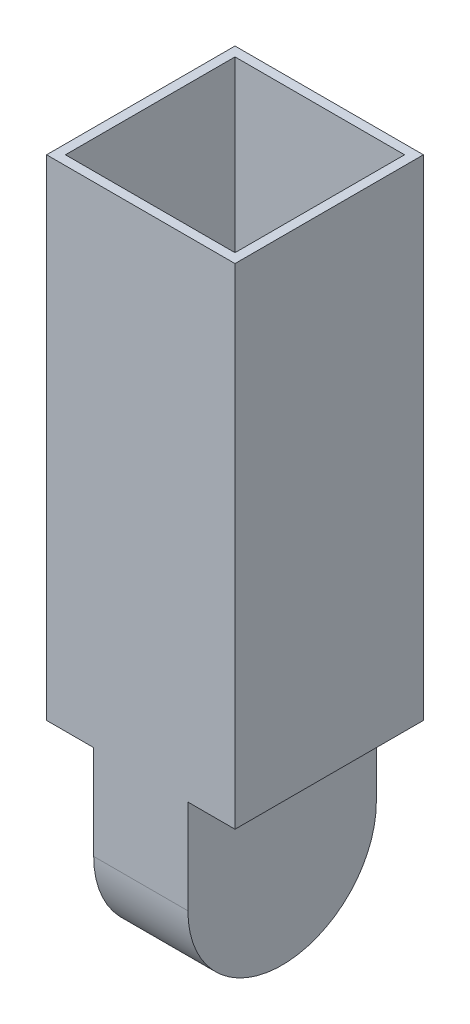
ISO-10303-21;
HEADER;
FILE_DESCRIPTION(('STEP AP214'),'2;1');
FILE_NAME('part.step','',(''),(''),'','','');
FILE_SCHEMA(('AUTOMOTIVE_DESIGN { 1 0 10303 214 1 1 1 1 }'));
ENDSEC;
DATA;
#1=APPLICATION_CONTEXT('core data for automotive mechanical design processes');
#2=APPLICATION_PROTOCOL_DEFINITION('international standard','automotive_design',2000,#1);
#3=PRODUCT_CONTEXT('',#1,'mechanical');
#4=PRODUCT('Part','Part','',(#3));
#5=PRODUCT_RELATED_PRODUCT_CATEGORY('part','',(#4));
#6=PRODUCT_DEFINITION_FORMATION('','',#4);
#7=PRODUCT_DEFINITION_CONTEXT('part definition',#1,'design');
#8=PRODUCT_DEFINITION('design','',#6,#7);
#9=PRODUCT_DEFINITION_SHAPE('','',#8);
#10=(LENGTH_UNIT() NAMED_UNIT(*) SI_UNIT(.MILLI.,.METRE.));
#11=(NAMED_UNIT(*) PLANE_ANGLE_UNIT() SI_UNIT($,.RADIAN.));
#12=(NAMED_UNIT(*) SI_UNIT($,.STERADIAN.) SOLID_ANGLE_UNIT());
#13=UNCERTAINTY_MEASURE_WITH_UNIT(LENGTH_MEASURE(1.E-05),#10,'distance_accuracy_value','');
#14=(GEOMETRIC_REPRESENTATION_CONTEXT(3) GLOBAL_UNCERTAINTY_ASSIGNED_CONTEXT((#13)) GLOBAL_UNIT_ASSIGNED_CONTEXT((#10,
#11,#12)) REPRESENTATION_CONTEXT('',''));
#15=CARTESIAN_POINT('',(0.,0.,0.));
#16=DIRECTION('',(0.,0.,1.));
#17=DIRECTION('',(1.,0.,0.));
#18=AXIS2_PLACEMENT_3D('',#15,#16,#17);
#19=CARTESIAN_POINT('',(0.,-2.,0.));
#20=DIRECTION('',(0.,-1.,0.));
#21=DIRECTION('',(0.,0.,-1.));
#22=AXIS2_PLACEMENT_3D('',#19,#20,#21);
#23=PLANE('',#22);
#24=DIRECTION('',(1.,0.,0.));
#25=VECTOR('',#24,1.);
#26=CARTESIAN_POINT('',(-10.,-2.,-10.));
#27=LINE('',#26,#25);
#28=CARTESIAN_POINT('',(-10.,-2.,-10.));
#29=VERTEX_POINT('',#28);
#30=CARTESIAN_POINT('',(-5.,-2.,-10.));
#31=VERTEX_POINT('',#30);
#32=EDGE_CURVE('E153',#29,#31,#27,.T.);
#33=ORIENTED_EDGE('',*,*,#32,.T.);
#34=DIRECTION('',(0.,0.,1.));
#35=VECTOR('',#34,1.);
#36=CARTESIAN_POINT('',(-5.,-2.,10.));
#37=LINE('',#36,#35);
#38=CARTESIAN_POINT('',(-5.,-2.,10.));
#39=VERTEX_POINT('',#38);
#40=EDGE_CURVE('E47',#31,#39,#37,.T.);
#41=ORIENTED_EDGE('',*,*,#40,.T.);
#42=DIRECTION('',(-1.,0.,0.));
#43=VECTOR('',#42,1.);
#44=CARTESIAN_POINT('',(-10.,-2.,10.));
#45=LINE('',#44,#43);
#46=CARTESIAN_POINT('',(-10.,-2.,10.));
#47=VERTEX_POINT('',#46);
#48=EDGE_CURVE('E158',#39,#47,#45,.T.);
#49=ORIENTED_EDGE('',*,*,#48,.T.);
#50=DIRECTION('',(0.,0.,-1.));
#51=VECTOR('',#50,1.);
#52=CARTESIAN_POINT('',(-10.,-2.,10.));
#53=LINE('',#52,#51);
#54=EDGE_CURVE('E145',#47,#29,#53,.T.);
#55=ORIENTED_EDGE('',*,*,#54,.T.);
#56=EDGE_LOOP('',(#33,#41,#49,#55));
#57=FACE_BOUND('',#56,.T.);
#58=ADVANCED_FACE('F32',(#57),#23,.T.);
#59=CARTESIAN_POINT('',(0.,50.,0.));
#60=DIRECTION('',(0.,1.,0.));
#61=DIRECTION('',(0.,0.,1.));
#62=AXIS2_PLACEMENT_3D('',#59,#60,#61);
#63=PLANE('',#62);
#64=DIRECTION('',(0.,0.,1.));
#65=VECTOR('',#64,1.);
#66=CARTESIAN_POINT('',(-10.,50.,-10.));
#67=LINE('',#66,#65);
#68=CARTESIAN_POINT('',(-10.,50.,-10.));
#69=VERTEX_POINT('',#68);
#70=CARTESIAN_POINT('',(-10.,50.,10.));
#71=VERTEX_POINT('',#70);
#72=EDGE_CURVE('E191',#69,#71,#67,.T.);
#73=ORIENTED_EDGE('',*,*,#72,.T.);
#74=DIRECTION('',(1.,0.,0.));
#75=VECTOR('',#74,1.);
#76=CARTESIAN_POINT('',(-10.,50.,10.));
#77=LINE('',#76,#75);
#78=CARTESIAN_POINT('',(10.,50.,10.));
#79=VERTEX_POINT('',#78);
#80=EDGE_CURVE('E194',#71,#79,#77,.T.);
#81=ORIENTED_EDGE('',*,*,#80,.T.);
#82=DIRECTION('',(0.,0.,-1.));
#83=VECTOR('',#82,1.);
#84=CARTESIAN_POINT('',(10.,50.,-10.));
#85=LINE('',#84,#83);
#86=CARTESIAN_POINT('',(10.,50.,-10.));
#87=VERTEX_POINT('',#86);
#88=EDGE_CURVE('E196',#79,#87,#85,.T.);
#89=ORIENTED_EDGE('',*,*,#88,.T.);
#90=DIRECTION('',(-1.,0.,0.));
#91=VECTOR('',#90,1.);
#92=CARTESIAN_POINT('',(-10.,50.,-10.));
#93=LINE('',#92,#91);
#94=EDGE_CURVE('E198',#87,#69,#93,.T.);
#95=ORIENTED_EDGE('',*,*,#94,.T.);
#96=EDGE_LOOP('',(#73,#81,#89,#95));
#97=FACE_BOUND('',#96,.T.);
#98=DIRECTION('',(1.,0.,0.));
#99=VECTOR('',#98,1.);
#100=CARTESIAN_POINT('',(-9.,50.,9.));
#101=LINE('',#100,#99);
#102=CARTESIAN_POINT('',(-9.,50.,9.));
#103=VERTEX_POINT('',#102);
#104=CARTESIAN_POINT('',(9.,50.,9.));
#105=VERTEX_POINT('',#104);
#106=EDGE_CURVE('E164',#103,#105,#101,.T.);
#107=ORIENTED_EDGE('',*,*,#106,.F.);
#108=DIRECTION('',(0.,0.,1.));
#109=VECTOR('',#108,1.);
#110=CARTESIAN_POINT('',(-9.,50.,-9.));
#111=LINE('',#110,#109);
#112=CARTESIAN_POINT('',(-9.,50.,-9.));
#113=VERTEX_POINT('',#112);
#114=EDGE_CURVE('E162',#113,#103,#111,.T.);
#115=ORIENTED_EDGE('',*,*,#114,.F.);
#116=DIRECTION('',(-1.,0.,0.));
#117=VECTOR('',#116,1.);
#118=CARTESIAN_POINT('',(-9.,50.,-9.));
#119=LINE('',#118,#117);
#120=CARTESIAN_POINT('',(9.,50.,-9.));
#121=VERTEX_POINT('',#120);
#122=EDGE_CURVE('E170',#121,#113,#119,.T.);
#123=ORIENTED_EDGE('',*,*,#122,.F.);
#124=DIRECTION('',(0.,0.,-1.));
#125=VECTOR('',#124,1.);
#126=CARTESIAN_POINT('',(9.,50.,-9.));
#127=LINE('',#126,#125);
#128=EDGE_CURVE('E167',#105,#121,#127,.T.);
#129=ORIENTED_EDGE('',*,*,#128,.F.);
#130=EDGE_LOOP('',(#107,#115,#123,#129));
#131=FACE_BOUND('',#130,.T.);
#132=ADVANCED_FACE('F230',(#97,#131),#63,.T.);
#133=CARTESIAN_POINT('',(-10.,50.,-10.));
#134=DIRECTION('',(1.,0.,0.));
#135=DIRECTION('',(0.,0.,-1.));
#136=AXIS2_PLACEMENT_3D('',#133,#134,#135);
#137=PLANE('',#136);
#138=DIRECTION('',(0.,-1.,0.));
#139=VECTOR('',#138,1.);
#140=CARTESIAN_POINT('',(-10.,50.,-10.));
#141=LINE('',#140,#139);
#142=EDGE_CURVE('E200',#69,#29,#141,.T.);
#143=ORIENTED_EDGE('',*,*,#142,.T.);
#144=ORIENTED_EDGE('',*,*,#54,.F.);
#145=DIRECTION('',(0.,-1.,0.));
#146=VECTOR('',#145,1.);
#147=CARTESIAN_POINT('',(-10.,50.,10.));
#148=LINE('',#147,#146);
#149=EDGE_CURVE('E11',#71,#47,#148,.T.);
#150=ORIENTED_EDGE('',*,*,#149,.F.);
#151=ORIENTED_EDGE('',*,*,#72,.F.);
#152=EDGE_LOOP('',(#143,#144,#150,#151));
#153=FACE_BOUND('',#152,.T.);
#154=ADVANCED_FACE('F34',(#153),#137,.F.);
#155=CARTESIAN_POINT('',(-10.,50.,10.));
#156=DIRECTION('',(0.,0.,-1.));
#157=DIRECTION('',(-1.,0.,0.));
#158=AXIS2_PLACEMENT_3D('',#155,#156,#157);
#159=PLANE('',#158);
#160=ORIENTED_EDGE('',*,*,#149,.T.);
#161=ORIENTED_EDGE('',*,*,#48,.F.);
#162=DIRECTION('',(0.,-1.,0.));
#163=VECTOR('',#162,1.);
#164=CARTESIAN_POINT('',(-5.,-12.,10.));
#165=LINE('',#164,#163);
#166=CARTESIAN_POINT('',(-5.,-12.,10.));
#167=VERTEX_POINT('',#166);
#168=EDGE_CURVE('E140',#39,#167,#165,.T.);
#169=ORIENTED_EDGE('',*,*,#168,.T.);
#170=DIRECTION('',(-1.,0.,0.));
#171=VECTOR('',#170,1.);
#172=CARTESIAN_POINT('',(5.,-12.,10.));
#173=LINE('',#172,#171);
#174=CARTESIAN_POINT('',(5.,-12.,10.));
#175=VERTEX_POINT('',#174);
#176=EDGE_CURVE('E146',#175,#167,#173,.T.);
#177=ORIENTED_EDGE('',*,*,#176,.F.);
#178=DIRECTION('',(0.,-1.,0.));
#179=VECTOR('',#178,1.);
#180=CARTESIAN_POINT('',(5.,-12.,10.));
#181=LINE('',#180,#179);
#182=CARTESIAN_POINT('',(5.,-2.,10.));
#183=VERTEX_POINT('',#182);
#184=EDGE_CURVE('E136',#183,#175,#181,.T.);
#185=ORIENTED_EDGE('',*,*,#184,.F.);
#186=CARTESIAN_POINT('',(10.,-2.,10.));
#187=VERTEX_POINT('',#186);
#188=EDGE_CURVE('E159',#187,#183,#45,.T.);
#189=ORIENTED_EDGE('',*,*,#188,.F.);
#190=DIRECTION('',(0.,-1.,0.));
#191=VECTOR('',#190,1.);
#192=CARTESIAN_POINT('',(10.,50.,10.));
#193=LINE('',#192,#191);
#194=EDGE_CURVE('E40',#79,#187,#193,.T.);
#195=ORIENTED_EDGE('',*,*,#194,.F.);
#196=ORIENTED_EDGE('',*,*,#80,.F.);
#197=EDGE_LOOP('',(#160,#161,#169,#177,#185,#189,#195,#196));
#198=FACE_BOUND('',#197,.T.);
#199=ADVANCED_FACE('F212',(#198),#159,.F.);
#200=CARTESIAN_POINT('',(10.,50.,-10.));
#201=DIRECTION('',(-1.,0.,0.));
#202=DIRECTION('',(0.,0.,1.));
#203=AXIS2_PLACEMENT_3D('',#200,#201,#202);
#204=PLANE('',#203);
#205=ORIENTED_EDGE('',*,*,#194,.T.);
#206=DIRECTION('',(0.,0.,1.));
#207=VECTOR('',#206,1.);
#208=CARTESIAN_POINT('',(10.,-2.,10.));
#209=LINE('',#208,#207);
#210=CARTESIAN_POINT('',(10.,-2.,-10.));
#211=VERTEX_POINT('',#210);
#212=EDGE_CURVE('E155',#211,#187,#209,.T.);
#213=ORIENTED_EDGE('',*,*,#212,.F.);
#214=DIRECTION('',(0.,-1.,0.));
#215=VECTOR('',#214,1.);
#216=CARTESIAN_POINT('',(10.,50.,-10.));
#217=LINE('',#216,#215);
#218=EDGE_CURVE('E202',#87,#211,#217,.T.);
#219=ORIENTED_EDGE('',*,*,#218,.F.);
#220=ORIENTED_EDGE('',*,*,#88,.F.);
#221=EDGE_LOOP('',(#205,#213,#219,#220));
#222=FACE_BOUND('',#221,.T.);
#223=ADVANCED_FACE('F207',(#222),#204,.F.);
#224=CARTESIAN_POINT('',(-10.,50.,-10.));
#225=DIRECTION('',(0.,0.,1.));
#226=DIRECTION('',(1.,0.,0.));
#227=AXIS2_PLACEMENT_3D('',#224,#225,#226);
#228=PLANE('',#227);
#229=ORIENTED_EDGE('',*,*,#218,.T.);
#230=CARTESIAN_POINT('',(5.,-2.,-10.));
#231=VERTEX_POINT('',#230);
#232=EDGE_CURVE('E129',#231,#211,#27,.T.);
#233=ORIENTED_EDGE('',*,*,#232,.F.);
#234=DIRECTION('',(0.,1.,0.));
#235=VECTOR('',#234,1.);
#236=CARTESIAN_POINT('',(5.,-12.,-10.));
#237=LINE('',#236,#235);
#238=CARTESIAN_POINT('',(5.,-12.,-10.));
#239=VERTEX_POINT('',#238);
#240=EDGE_CURVE('E121',#239,#231,#237,.T.);
#241=ORIENTED_EDGE('',*,*,#240,.F.);
#242=DIRECTION('',(-1.,0.,0.));
#243=VECTOR('',#242,1.);
#244=CARTESIAN_POINT('',(5.,-12.,-10.));
#245=LINE('',#244,#243);
#246=CARTESIAN_POINT('',(-5.,-12.,-10.));
#247=VERTEX_POINT('',#246);
#248=EDGE_CURVE('E127',#239,#247,#245,.T.);
#249=ORIENTED_EDGE('',*,*,#248,.T.);
#250=DIRECTION('',(0.,1.,0.));
#251=VECTOR('',#250,1.);
#252=CARTESIAN_POINT('',(-5.,-12.,-10.));
#253=LINE('',#252,#251);
#254=EDGE_CURVE('E217',#247,#31,#253,.T.);
#255=ORIENTED_EDGE('',*,*,#254,.T.);
#256=ORIENTED_EDGE('',*,*,#32,.F.);
#257=ORIENTED_EDGE('',*,*,#142,.F.);
#258=ORIENTED_EDGE('',*,*,#94,.F.);
#259=EDGE_LOOP('',(#229,#233,#241,#249,#255,#256,#257,#258));
#260=FACE_BOUND('',#259,.T.);
#261=ADVANCED_FACE('F124',(#260),#228,.F.);
#262=CARTESIAN_POINT('',(-9.,50.,-9.));
#263=DIRECTION('',(1.,0.,0.));
#264=DIRECTION('',(0.,0.,-1.));
#265=AXIS2_PLACEMENT_3D('',#262,#263,#264);
#266=PLANE('',#265);
#267=DIRECTION('',(0.,0.,1.));
#268=VECTOR('',#267,1.);
#269=CARTESIAN_POINT('',(-9.,0.,-9.));
#270=LINE('',#269,#268);
#271=CARTESIAN_POINT('',(-9.,0.,-9.));
#272=VERTEX_POINT('',#271);
#273=CARTESIAN_POINT('',(-9.,0.,9.));
#274=VERTEX_POINT('',#273);
#275=EDGE_CURVE('E161',#272,#274,#270,.T.);
#276=ORIENTED_EDGE('',*,*,#275,.F.);
#277=DIRECTION('',(0.,-1.,0.));
#278=VECTOR('',#277,1.);
#279=CARTESIAN_POINT('',(-9.,50.,-9.));
#280=LINE('',#279,#278);
#281=EDGE_CURVE('E172',#113,#272,#280,.T.);
#282=ORIENTED_EDGE('',*,*,#281,.F.);
#283=ORIENTED_EDGE('',*,*,#114,.T.);
#284=DIRECTION('',(0.,-1.,0.));
#285=VECTOR('',#284,1.);
#286=CARTESIAN_POINT('',(-9.,50.,9.));
#287=LINE('',#286,#285);
#288=EDGE_CURVE('E188',#103,#274,#287,.T.);
#289=ORIENTED_EDGE('',*,*,#288,.T.);
#290=EDGE_LOOP('',(#276,#282,#283,#289));
#291=FACE_BOUND('',#290,.T.);
#292=ADVANCED_FACE('F250',(#291),#266,.T.);
#293=CARTESIAN_POINT('',(-9.,50.,9.));
#294=DIRECTION('',(0.,0.,-1.));
#295=DIRECTION('',(-1.,0.,0.));
#296=AXIS2_PLACEMENT_3D('',#293,#294,#295);
#297=PLANE('',#296);
#298=DIRECTION('',(1.,0.,0.));
#299=VECTOR('',#298,1.);
#300=CARTESIAN_POINT('',(-9.,0.,9.));
#301=LINE('',#300,#299);
#302=CARTESIAN_POINT('',(9.,0.,9.));
#303=VERTEX_POINT('',#302);
#304=EDGE_CURVE('E175',#274,#303,#301,.T.);
#305=ORIENTED_EDGE('',*,*,#304,.F.);
#306=ORIENTED_EDGE('',*,*,#288,.F.);
#307=ORIENTED_EDGE('',*,*,#106,.T.);
#308=DIRECTION('',(0.,-1.,0.));
#309=VECTOR('',#308,1.);
#310=CARTESIAN_POINT('',(9.,50.,9.));
#311=LINE('',#310,#309);
#312=EDGE_CURVE('E186',#105,#303,#311,.T.);
#313=ORIENTED_EDGE('',*,*,#312,.T.);
#314=EDGE_LOOP('',(#305,#306,#307,#313));
#315=FACE_BOUND('',#314,.T.);
#316=ADVANCED_FACE('F241',(#315),#297,.T.);
#317=CARTESIAN_POINT('',(9.,50.,-9.));
#318=DIRECTION('',(-1.,0.,0.));
#319=DIRECTION('',(0.,0.,1.));
#320=AXIS2_PLACEMENT_3D('',#317,#318,#319);
#321=PLANE('',#320);
#322=DIRECTION('',(0.,0.,-1.));
#323=VECTOR('',#322,1.);
#324=CARTESIAN_POINT('',(9.,0.,-9.));
#325=LINE('',#324,#323);
#326=CARTESIAN_POINT('',(9.,0.,-9.));
#327=VERTEX_POINT('',#326);
#328=EDGE_CURVE('E178',#303,#327,#325,.T.);
#329=ORIENTED_EDGE('',*,*,#328,.F.);
#330=ORIENTED_EDGE('',*,*,#312,.F.);
#331=ORIENTED_EDGE('',*,*,#128,.T.);
#332=DIRECTION('',(0.,-1.,0.));
#333=VECTOR('',#332,1.);
#334=CARTESIAN_POINT('',(9.,50.,-9.));
#335=LINE('',#334,#333);
#336=EDGE_CURVE('E184',#121,#327,#335,.T.);
#337=ORIENTED_EDGE('',*,*,#336,.T.);
#338=EDGE_LOOP('',(#329,#330,#331,#337));
#339=FACE_BOUND('',#338,.T.);
#340=ADVANCED_FACE('F244',(#339),#321,.T.);
#341=CARTESIAN_POINT('',(-9.,50.,-9.));
#342=DIRECTION('',(0.,0.,1.));
#343=DIRECTION('',(1.,0.,0.));
#344=AXIS2_PLACEMENT_3D('',#341,#342,#343);
#345=PLANE('',#344);
#346=DIRECTION('',(-1.,0.,0.));
#347=VECTOR('',#346,1.);
#348=CARTESIAN_POINT('',(-9.,0.,-9.));
#349=LINE('',#348,#347);
#350=EDGE_CURVE('E165',#327,#272,#349,.T.);
#351=ORIENTED_EDGE('',*,*,#350,.F.);
#352=ORIENTED_EDGE('',*,*,#336,.F.);
#353=ORIENTED_EDGE('',*,*,#122,.T.);
#354=ORIENTED_EDGE('',*,*,#281,.T.);
#355=EDGE_LOOP('',(#351,#352,#353,#354));
#356=FACE_BOUND('',#355,.T.);
#357=ADVANCED_FACE('F253',(#356),#345,.T.);
#358=CARTESIAN_POINT('',(0.,0.,0.));
#359=DIRECTION('',(0.,-1.,0.));
#360=DIRECTION('',(0.,0.,-1.));
#361=AXIS2_PLACEMENT_3D('',#358,#359,#360);
#362=PLANE('',#361);
#363=ORIENTED_EDGE('',*,*,#350,.T.);
#364=ORIENTED_EDGE('',*,*,#275,.T.);
#365=ORIENTED_EDGE('',*,*,#304,.T.);
#366=ORIENTED_EDGE('',*,*,#328,.T.);
#367=EDGE_LOOP('',(#363,#364,#365,#366));
#368=FACE_BOUND('',#367,.T.);
#369=ADVANCED_FACE('F247',(#368),#362,.F.);
#370=DIRECTION('',(0.,0.,1.));
#371=VECTOR('',#370,1.);
#372=CARTESIAN_POINT('',(5.,-2.,10.));
#373=LINE('',#372,#371);
#374=EDGE_CURVE('E55',#231,#183,#373,.T.);
#375=ORIENTED_EDGE('',*,*,#374,.F.);
#376=ORIENTED_EDGE('',*,*,#232,.T.);
#377=ORIENTED_EDGE('',*,*,#212,.T.);
#378=ORIENTED_EDGE('',*,*,#188,.T.);
#379=EDGE_LOOP('',(#375,#376,#377,#378));
#380=FACE_BOUND('',#379,.T.);
#381=ADVANCED_FACE('F211',(#380),#23,.T.);
#382=CARTESIAN_POINT('',(5.,-12.,0.));
#383=DIRECTION('',(-1.,0.,0.));
#384=DIRECTION('',(0.,0.,1.));
#385=AXIS2_PLACEMENT_3D('',#382,#383,#384);
#386=CYLINDRICAL_SURFACE('',#385,10.);
#387=CARTESIAN_POINT('',(-5.,-12.,0.));
#388=DIRECTION('',(1.,0.,0.));
#389=DIRECTION('',(0.,0.,-1.));
#390=AXIS2_PLACEMENT_3D('',#387,#388,#389);
#391=CIRCLE('',#390,10.);
#392=EDGE_CURVE('E144',#167,#247,#391,.T.);
#393=ORIENTED_EDGE('',*,*,#392,.T.);
#394=ORIENTED_EDGE('',*,*,#248,.F.);
#395=CARTESIAN_POINT('',(5.,-12.,0.));
#396=DIRECTION('',(1.,0.,0.));
#397=DIRECTION('',(0.,0.,-1.));
#398=AXIS2_PLACEMENT_3D('',#395,#396,#397);
#399=CIRCLE('',#398,10.);
#400=EDGE_CURVE('E131',#175,#239,#399,.T.);
#401=ORIENTED_EDGE('',*,*,#400,.F.);
#402=ORIENTED_EDGE('',*,*,#176,.T.);
#403=EDGE_LOOP('',(#393,#394,#401,#402));
#404=FACE_BOUND('',#403,.T.);
#405=ADVANCED_FACE('F142',(#404),#386,.T.);
#406=CARTESIAN_POINT('',(5.,-12.,0.));
#407=DIRECTION('',(1.,0.,0.));
#408=DIRECTION('',(0.,0.,-1.));
#409=AXIS2_PLACEMENT_3D('',#406,#407,#408);
#410=PLANE('',#409);
#411=ORIENTED_EDGE('',*,*,#400,.T.);
#412=ORIENTED_EDGE('',*,*,#240,.T.);
#413=ORIENTED_EDGE('',*,*,#374,.T.);
#414=ORIENTED_EDGE('',*,*,#184,.T.);
#415=EDGE_LOOP('',(#411,#412,#413,#414));
#416=FACE_BOUND('',#415,.T.);
#417=ADVANCED_FACE('F134',(#416),#410,.T.);
#418=CARTESIAN_POINT('',(-5.,-12.,0.));
#419=DIRECTION('',(1.,0.,0.));
#420=DIRECTION('',(0.,0.,-1.));
#421=AXIS2_PLACEMENT_3D('',#418,#419,#420);
#422=PLANE('',#421);
#423=ORIENTED_EDGE('',*,*,#392,.F.);
#424=ORIENTED_EDGE('',*,*,#168,.F.);
#425=ORIENTED_EDGE('',*,*,#40,.F.);
#426=ORIENTED_EDGE('',*,*,#254,.F.);
#427=EDGE_LOOP('',(#423,#424,#425,#426));
#428=FACE_BOUND('',#427,.T.);
#429=ADVANCED_FACE('F221',(#428),#422,.F.);
#430=CLOSED_SHELL('',(#58,#132,#154,#199,#223,#261,#292,#316,#340,#357,#369,#381,#405,#417,#429));
#431=MANIFOLD_SOLID_BREP('B2',#430);
#432=ADVANCED_BREP_SHAPE_REPRESENTATION('',(#18,#431),#14);
#433=SHAPE_DEFINITION_REPRESENTATION(#9,#432);
ENDSEC;
END-ISO-10303-21;
